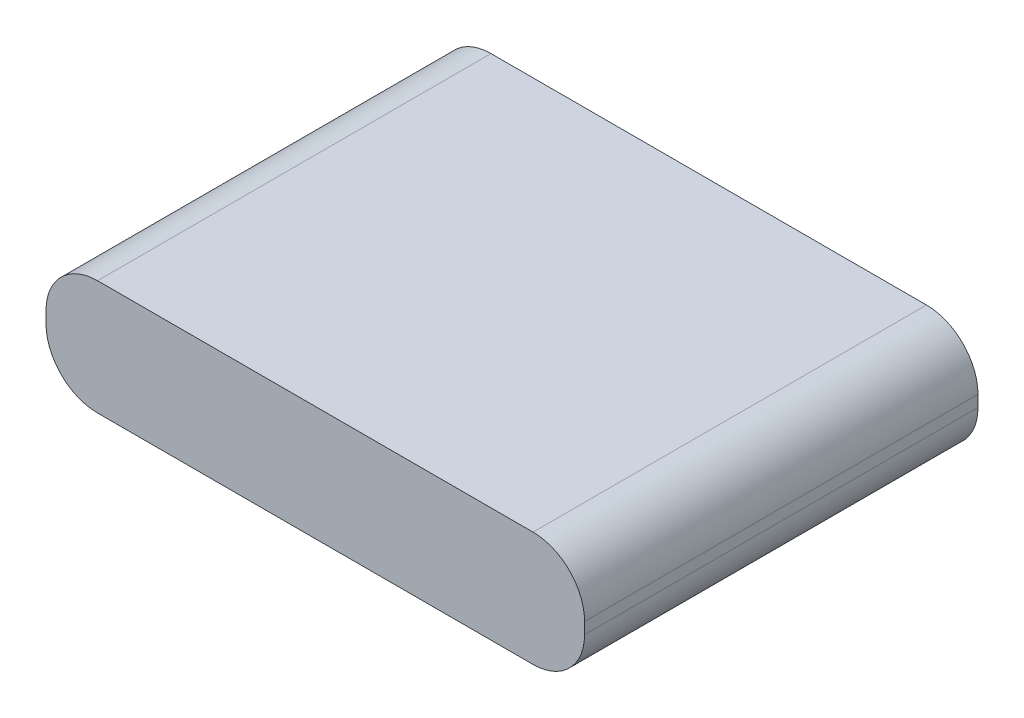
ISO-10303-21;
HEADER;
FILE_DESCRIPTION(('STEP AP214'),'2;1');
FILE_NAME('part.step','',(''),(''),'','','');
FILE_SCHEMA(('AUTOMOTIVE_DESIGN { 1 0 10303 214 1 1 1 1 }'));
ENDSEC;
DATA;
#1=APPLICATION_CONTEXT('core data for automotive mechanical design processes');
#2=APPLICATION_PROTOCOL_DEFINITION('international standard','automotive_design',2000,#1);
#3=PRODUCT_CONTEXT('',#1,'mechanical');
#4=PRODUCT('Part','Part','',(#3));
#5=PRODUCT_RELATED_PRODUCT_CATEGORY('part','',(#4));
#6=PRODUCT_DEFINITION_FORMATION('','',#4);
#7=PRODUCT_DEFINITION_CONTEXT('part definition',#1,'design');
#8=PRODUCT_DEFINITION('design','',#6,#7);
#9=PRODUCT_DEFINITION_SHAPE('','',#8);
#10=(LENGTH_UNIT() NAMED_UNIT(*) SI_UNIT(.MILLI.,.METRE.));
#11=(NAMED_UNIT(*) PLANE_ANGLE_UNIT() SI_UNIT($,.RADIAN.));
#12=(NAMED_UNIT(*) SI_UNIT($,.STERADIAN.) SOLID_ANGLE_UNIT());
#13=UNCERTAINTY_MEASURE_WITH_UNIT(LENGTH_MEASURE(1.E-05),#10,'distance_accuracy_value','');
#14=(GEOMETRIC_REPRESENTATION_CONTEXT(3) GLOBAL_UNCERTAINTY_ASSIGNED_CONTEXT((#13)) GLOBAL_UNIT_ASSIGNED_CONTEXT((#10,
#11,#12)) REPRESENTATION_CONTEXT('',''));
#15=CARTESIAN_POINT('',(0.,0.,0.));
#16=DIRECTION('',(0.,0.,1.));
#17=DIRECTION('',(1.,0.,0.));
#18=AXIS2_PLACEMENT_3D('',#15,#16,#17);
#19=CARTESIAN_POINT('',(35.25,15.,25.75));
#20=DIRECTION('',(-1.,0.,0.));
#21=DIRECTION('',(0.,0.,1.));
#22=AXIS2_PLACEMENT_3D('',#19,#20,#21);
#23=PLANE('',#22);
#24=DIRECTION('',(0.,-1.,0.));
#25=VECTOR('',#24,1.);
#26=CARTESIAN_POINT('',(35.25,15.,25.75));
#27=LINE('',#26,#25);
#28=CARTESIAN_POINT('',(35.25,8.25,25.75));
#29=VERTEX_POINT('',#28);
#30=CARTESIAN_POINT('',(35.25,6.75,25.75));
#31=VERTEX_POINT('',#30);
#32=EDGE_CURVE('E136',#29,#31,#27,.T.);
#33=ORIENTED_EDGE('',*,*,#32,.T.);
#34=DIRECTION('',(0.,0.,-1.));
#35=VECTOR('',#34,1.);
#36=CARTESIAN_POINT('',(35.25,6.75,-25.75));
#37=LINE('',#36,#35);
#38=CARTESIAN_POINT('',(35.25,6.75,-25.75));
#39=VERTEX_POINT('',#38);
#40=EDGE_CURVE('E11',#31,#39,#37,.T.);
#41=ORIENTED_EDGE('',*,*,#40,.T.);
#42=DIRECTION('',(0.,-1.,0.));
#43=VECTOR('',#42,1.);
#44=CARTESIAN_POINT('',(35.25,15.,-25.75));
#45=LINE('',#44,#43);
#46=CARTESIAN_POINT('',(35.25,8.25,-25.75));
#47=VERTEX_POINT('',#46);
#48=EDGE_CURVE('E142',#47,#39,#45,.T.);
#49=ORIENTED_EDGE('',*,*,#48,.F.);
#50=DIRECTION('',(0.,0.,-1.));
#51=VECTOR('',#50,1.);
#52=CARTESIAN_POINT('',(35.25,8.25,25.75));
#53=LINE('',#52,#51);
#54=EDGE_CURVE('E54',#47,#29,#53,.F.);
#55=ORIENTED_EDGE('',*,*,#54,.T.);
#56=EDGE_LOOP('',(#33,#41,#49,#55));
#57=FACE_BOUND('',#56,.T.);
#58=ADVANCED_FACE('F45',(#57),#23,.F.);
#59=CARTESIAN_POINT('',(-35.25,15.,-25.75));
#60=DIRECTION('',(0.,0.,1.));
#61=DIRECTION('',(1.,0.,0.));
#62=AXIS2_PLACEMENT_3D('',#59,#60,#61);
#63=PLANE('',#62);
#64=DIRECTION('',(-1.,0.,0.));
#65=VECTOR('',#64,1.);
#66=CARTESIAN_POINT('',(-35.25,0.,-25.75));
#67=LINE('',#66,#65);
#68=CARTESIAN_POINT('',(28.5,0.,-25.75));
#69=VERTEX_POINT('',#68);
#70=CARTESIAN_POINT('',(-28.5,0.,-25.75));
#71=VERTEX_POINT('',#70);
#72=EDGE_CURVE('E202',#69,#71,#67,.T.);
#73=ORIENTED_EDGE('',*,*,#72,.T.);
#74=CARTESIAN_POINT('',(-28.5,6.75,-25.75));
#75=DIRECTION('',(0.,0.,1.));
#76=DIRECTION('',(1.,0.,0.));
#77=AXIS2_PLACEMENT_3D('',#74,#75,#76);
#78=CIRCLE('',#77,6.75);
#79=CARTESIAN_POINT('',(-35.25,6.75,-25.75));
#80=VERTEX_POINT('',#79);
#81=EDGE_CURVE('E169',#71,#80,#78,.F.);
#82=ORIENTED_EDGE('',*,*,#81,.T.);
#83=DIRECTION('',(0.,-1.,0.));
#84=VECTOR('',#83,1.);
#85=CARTESIAN_POINT('',(-35.25,15.,-25.75));
#86=LINE('',#85,#84);
#87=CARTESIAN_POINT('',(-35.25,8.25,-25.75));
#88=VERTEX_POINT('',#87);
#89=EDGE_CURVE('E135',#88,#80,#86,.T.);
#90=ORIENTED_EDGE('',*,*,#89,.F.);
#91=CARTESIAN_POINT('',(-28.5,8.25,-25.75));
#92=DIRECTION('',(0.,0.,1.));
#93=DIRECTION('',(1.,0.,0.));
#94=AXIS2_PLACEMENT_3D('',#91,#92,#93);
#95=CIRCLE('',#94,6.75);
#96=CARTESIAN_POINT('',(-28.5,15.,-25.75));
#97=VERTEX_POINT('',#96);
#98=EDGE_CURVE('E140',#88,#97,#95,.F.);
#99=ORIENTED_EDGE('',*,*,#98,.T.);
#100=DIRECTION('',(-1.,0.,0.));
#101=VECTOR('',#100,1.);
#102=CARTESIAN_POINT('',(-35.25,15.,-25.75));
#103=LINE('',#102,#101);
#104=CARTESIAN_POINT('',(28.5,15.,-25.75));
#105=VERTEX_POINT('',#104);
#106=EDGE_CURVE('E193',#105,#97,#103,.T.);
#107=ORIENTED_EDGE('',*,*,#106,.F.);
#108=CARTESIAN_POINT('',(28.5,8.25,-25.75));
#109=DIRECTION('',(0.,0.,1.));
#110=DIRECTION('',(1.,0.,0.));
#111=AXIS2_PLACEMENT_3D('',#108,#109,#110);
#112=CIRCLE('',#111,6.75);
#113=EDGE_CURVE('E68',#105,#47,#112,.F.);
#114=ORIENTED_EDGE('',*,*,#113,.T.);
#115=ORIENTED_EDGE('',*,*,#48,.T.);
#116=CARTESIAN_POINT('',(28.5,6.75,-25.75));
#117=DIRECTION('',(0.,0.,1.));
#118=DIRECTION('',(1.,0.,0.));
#119=AXIS2_PLACEMENT_3D('',#116,#117,#118);
#120=CIRCLE('',#119,6.75);
#121=EDGE_CURVE('E61',#39,#69,#120,.F.);
#122=ORIENTED_EDGE('',*,*,#121,.T.);
#123=EDGE_LOOP('',(#73,#82,#90,#99,#107,#114,#115,#122));
#124=FACE_BOUND('',#123,.T.);
#125=ADVANCED_FACE('F195',(#124),#63,.F.);
#126=CARTESIAN_POINT('',(-35.25,15.,25.75));
#127=DIRECTION('',(1.,0.,0.));
#128=DIRECTION('',(0.,0.,-1.));
#129=AXIS2_PLACEMENT_3D('',#126,#127,#128);
#130=PLANE('',#129);
#131=ORIENTED_EDGE('',*,*,#89,.T.);
#132=DIRECTION('',(0.,0.,1.));
#133=VECTOR('',#132,1.);
#134=CARTESIAN_POINT('',(-35.25,6.75,25.75));
#135=LINE('',#134,#133);
#136=CARTESIAN_POINT('',(-35.25,6.75,25.75));
#137=VERTEX_POINT('',#136);
#138=EDGE_CURVE('E133',#80,#137,#135,.T.);
#139=ORIENTED_EDGE('',*,*,#138,.T.);
#140=DIRECTION('',(0.,-1.,0.));
#141=VECTOR('',#140,1.);
#142=CARTESIAN_POINT('',(-35.25,15.,25.75));
#143=LINE('',#142,#141);
#144=CARTESIAN_POINT('',(-35.25,8.25,25.75));
#145=VERTEX_POINT('',#144);
#146=EDGE_CURVE('E115',#145,#137,#143,.T.);
#147=ORIENTED_EDGE('',*,*,#146,.F.);
#148=DIRECTION('',(0.,0.,1.));
#149=VECTOR('',#148,1.);
#150=CARTESIAN_POINT('',(-35.25,8.25,25.75));
#151=LINE('',#150,#149);
#152=EDGE_CURVE('E130',#145,#88,#151,.F.);
#153=ORIENTED_EDGE('',*,*,#152,.T.);
#154=EDGE_LOOP('',(#131,#139,#147,#153));
#155=FACE_BOUND('',#154,.T.);
#156=ADVANCED_FACE('F129',(#155),#130,.F.);
#157=CARTESIAN_POINT('',(-35.25,15.,25.75));
#158=DIRECTION('',(0.,0.,-1.));
#159=DIRECTION('',(-1.,0.,0.));
#160=AXIS2_PLACEMENT_3D('',#157,#158,#159);
#161=PLANE('',#160);
#162=ORIENTED_EDGE('',*,*,#146,.T.);
#163=CARTESIAN_POINT('',(-28.5,6.75,25.75));
#164=DIRECTION('',(0.,0.,-1.));
#165=DIRECTION('',(-1.,0.,0.));
#166=AXIS2_PLACEMENT_3D('',#163,#164,#165);
#167=CIRCLE('',#166,6.75);
#168=CARTESIAN_POINT('',(-28.5,0.,25.75));
#169=VERTEX_POINT('',#168);
#170=EDGE_CURVE('E123',#137,#169,#167,.F.);
#171=ORIENTED_EDGE('',*,*,#170,.T.);
#172=DIRECTION('',(1.,0.,0.));
#173=VECTOR('',#172,1.);
#174=CARTESIAN_POINT('',(-35.25,0.,25.75));
#175=LINE('',#174,#173);
#176=CARTESIAN_POINT('',(28.5,0.,25.75));
#177=VERTEX_POINT('',#176);
#178=EDGE_CURVE('E197',#169,#177,#175,.T.);
#179=ORIENTED_EDGE('',*,*,#178,.T.);
#180=CARTESIAN_POINT('',(28.5,6.75,25.75));
#181=DIRECTION('',(0.,0.,-1.));
#182=DIRECTION('',(-1.,0.,0.));
#183=AXIS2_PLACEMENT_3D('',#180,#181,#182);
#184=CIRCLE('',#183,6.75);
#185=EDGE_CURVE('E124',#177,#31,#184,.F.);
#186=ORIENTED_EDGE('',*,*,#185,.T.);
#187=ORIENTED_EDGE('',*,*,#32,.F.);
#188=CARTESIAN_POINT('',(28.5,8.25,25.75));
#189=DIRECTION('',(0.,0.,-1.));
#190=DIRECTION('',(-1.,0.,0.));
#191=AXIS2_PLACEMENT_3D('',#188,#189,#190);
#192=CIRCLE('',#191,6.75);
#193=CARTESIAN_POINT('',(28.5,15.,25.75));
#194=VERTEX_POINT('',#193);
#195=EDGE_CURVE('E146',#29,#194,#192,.F.);
#196=ORIENTED_EDGE('',*,*,#195,.T.);
#197=DIRECTION('',(1.,0.,0.));
#198=VECTOR('',#197,1.);
#199=CARTESIAN_POINT('',(-35.25,15.,25.75));
#200=LINE('',#199,#198);
#201=CARTESIAN_POINT('',(-28.5,15.,25.75));
#202=VERTEX_POINT('',#201);
#203=EDGE_CURVE('E117',#202,#194,#200,.T.);
#204=ORIENTED_EDGE('',*,*,#203,.F.);
#205=CARTESIAN_POINT('',(-28.5,8.25,25.75));
#206=DIRECTION('',(0.,0.,-1.));
#207=DIRECTION('',(-1.,0.,0.));
#208=AXIS2_PLACEMENT_3D('',#205,#206,#207);
#209=CIRCLE('',#208,6.75);
#210=EDGE_CURVE('E112',#202,#145,#209,.F.);
#211=ORIENTED_EDGE('',*,*,#210,.T.);
#212=EDGE_LOOP('',(#162,#171,#179,#186,#187,#196,#204,#211));
#213=FACE_BOUND('',#212,.T.);
#214=ADVANCED_FACE('F114',(#213),#161,.F.);
#215=CARTESIAN_POINT('',(0.,15.,0.));
#216=DIRECTION('',(0.,-1.,0.));
#217=DIRECTION('',(0.,0.,-1.));
#218=AXIS2_PLACEMENT_3D('',#215,#216,#217);
#219=PLANE('',#218);
#220=ORIENTED_EDGE('',*,*,#106,.T.);
#221=DIRECTION('',(0.,0.,1.));
#222=VECTOR('',#221,1.);
#223=CARTESIAN_POINT('',(-28.5,15.,0.));
#224=LINE('',#223,#222);
#225=EDGE_CURVE('E176',#97,#202,#224,.T.);
#226=ORIENTED_EDGE('',*,*,#225,.T.);
#227=ORIENTED_EDGE('',*,*,#203,.T.);
#228=DIRECTION('',(0.,0.,-1.));
#229=VECTOR('',#228,1.);
#230=CARTESIAN_POINT('',(28.5,15.,0.));
#231=LINE('',#230,#229);
#232=EDGE_CURVE('E172',#194,#105,#231,.T.);
#233=ORIENTED_EDGE('',*,*,#232,.T.);
#234=EDGE_LOOP('',(#220,#226,#227,#233));
#235=FACE_BOUND('',#234,.T.);
#236=ADVANCED_FACE('F192',(#235),#219,.F.);
#237=CARTESIAN_POINT('',(0.,0.,0.));
#238=DIRECTION('',(0.,-1.,0.));
#239=DIRECTION('',(0.,0.,-1.));
#240=AXIS2_PLACEMENT_3D('',#237,#238,#239);
#241=PLANE('',#240);
#242=ORIENTED_EDGE('',*,*,#178,.F.);
#243=DIRECTION('',(0.,0.,1.));
#244=VECTOR('',#243,1.);
#245=CARTESIAN_POINT('',(-28.5,0.,-25.75));
#246=LINE('',#245,#244);
#247=EDGE_CURVE('E160',#169,#71,#246,.F.);
#248=ORIENTED_EDGE('',*,*,#247,.T.);
#249=ORIENTED_EDGE('',*,*,#72,.F.);
#250=DIRECTION('',(0.,0.,-1.));
#251=VECTOR('',#250,1.);
#252=CARTESIAN_POINT('',(28.5,0.,25.75));
#253=LINE('',#252,#251);
#254=EDGE_CURVE('E157',#69,#177,#253,.F.);
#255=ORIENTED_EDGE('',*,*,#254,.T.);
#256=EDGE_LOOP('',(#242,#248,#249,#255));
#257=FACE_BOUND('',#256,.T.);
#258=ADVANCED_FACE('F213',(#257),#241,.T.);
#259=CARTESIAN_POINT('',(-28.5,6.75,25.75));
#260=DIRECTION('',(0.,0.,-1.));
#261=DIRECTION('',(-1.,0.,0.));
#262=AXIS2_PLACEMENT_3D('',#259,#260,#261);
#263=CYLINDRICAL_SURFACE('',#262,6.75);
#264=ORIENTED_EDGE('',*,*,#81,.F.);
#265=ORIENTED_EDGE('',*,*,#247,.F.);
#266=ORIENTED_EDGE('',*,*,#170,.F.);
#267=ORIENTED_EDGE('',*,*,#138,.F.);
#268=EDGE_LOOP('',(#264,#265,#266,#267));
#269=FACE_BOUND('',#268,.T.);
#270=ADVANCED_FACE('F209',(#269),#263,.T.);
#271=CARTESIAN_POINT('',(-28.5,8.25,0.));
#272=DIRECTION('',(0.,0.,1.));
#273=DIRECTION('',(1.,0.,0.));
#274=AXIS2_PLACEMENT_3D('',#271,#272,#273);
#275=CYLINDRICAL_SURFACE('',#274,6.75);
#276=ORIENTED_EDGE('',*,*,#98,.F.);
#277=ORIENTED_EDGE('',*,*,#152,.F.);
#278=ORIENTED_EDGE('',*,*,#210,.F.);
#279=ORIENTED_EDGE('',*,*,#225,.F.);
#280=EDGE_LOOP('',(#276,#277,#278,#279));
#281=FACE_BOUND('',#280,.T.);
#282=ADVANCED_FACE('F139',(#281),#275,.T.);
#283=CARTESIAN_POINT('',(28.5,6.75,25.75));
#284=DIRECTION('',(0.,0.,1.));
#285=DIRECTION('',(1.,0.,0.));
#286=AXIS2_PLACEMENT_3D('',#283,#284,#285);
#287=CYLINDRICAL_SURFACE('',#286,6.75);
#288=ORIENTED_EDGE('',*,*,#185,.F.);
#289=ORIENTED_EDGE('',*,*,#254,.F.);
#290=ORIENTED_EDGE('',*,*,#121,.F.);
#291=ORIENTED_EDGE('',*,*,#40,.F.);
#292=EDGE_LOOP('',(#288,#289,#290,#291));
#293=FACE_BOUND('',#292,.T.);
#294=ADVANCED_FACE('F215',(#293),#287,.T.);
#295=CARTESIAN_POINT('',(28.5,8.25,0.));
#296=DIRECTION('',(0.,0.,-1.));
#297=DIRECTION('',(-1.,0.,0.));
#298=AXIS2_PLACEMENT_3D('',#295,#296,#297);
#299=CYLINDRICAL_SURFACE('',#298,6.75);
#300=ORIENTED_EDGE('',*,*,#195,.F.);
#301=ORIENTED_EDGE('',*,*,#54,.F.);
#302=ORIENTED_EDGE('',*,*,#113,.F.);
#303=ORIENTED_EDGE('',*,*,#232,.F.);
#304=EDGE_LOOP('',(#300,#301,#302,#303));
#305=FACE_BOUND('',#304,.T.);
#306=ADVANCED_FACE('F47',(#305),#299,.T.);
#307=CLOSED_SHELL('',(#58,#125,#156,#214,#236,#258,#270,#282,#294,#306));
#308=MANIFOLD_SOLID_BREP('B2',#307);
#309=ADVANCED_BREP_SHAPE_REPRESENTATION('',(#18,#308),#14);
#310=SHAPE_DEFINITION_REPRESENTATION(#9,#309);
ENDSEC;
END-ISO-10303-21;
